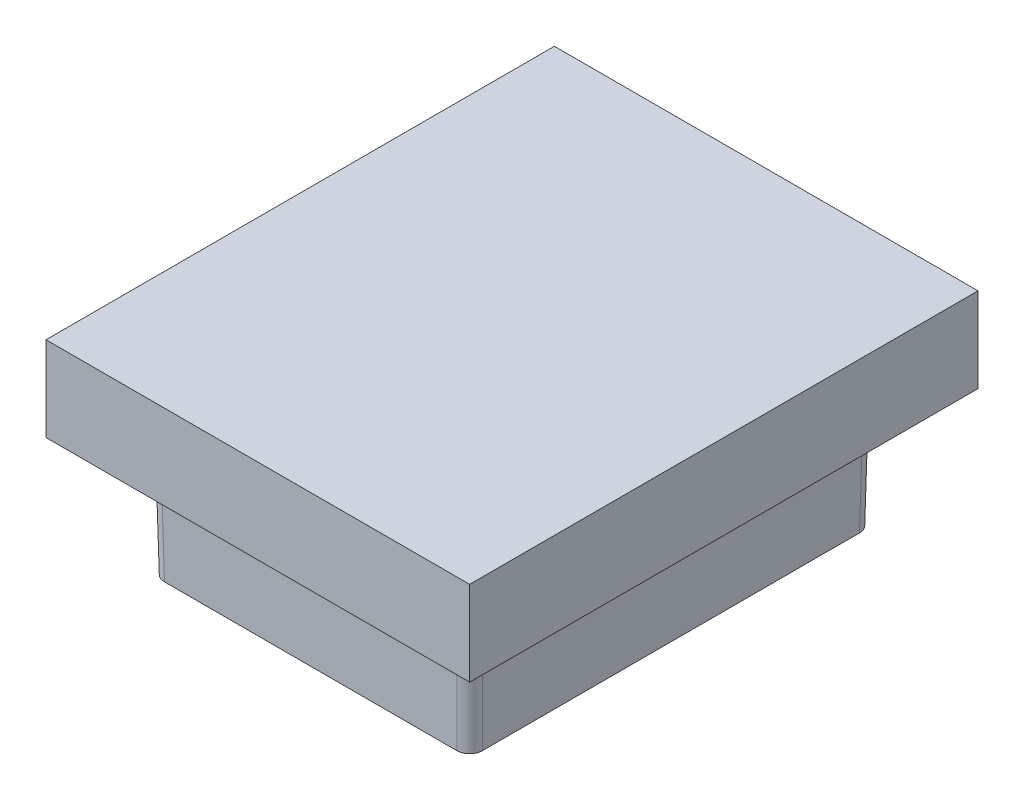
ISO-10303-21;
HEADER;
FILE_DESCRIPTION(('STEP AP214'),'2;1');
FILE_NAME('part.step','',(''),(''),'','','');
FILE_SCHEMA(('AUTOMOTIVE_DESIGN { 1 0 10303 214 1 1 1 1 }'));
ENDSEC;
DATA;
#1=APPLICATION_CONTEXT('core data for automotive mechanical design processes');
#2=APPLICATION_PROTOCOL_DEFINITION('international standard','automotive_design',2000,#1);
#3=PRODUCT_CONTEXT('',#1,'mechanical');
#4=PRODUCT('Part','Part','',(#3));
#5=PRODUCT_RELATED_PRODUCT_CATEGORY('part','',(#4));
#6=PRODUCT_DEFINITION_FORMATION('','',#4);
#7=PRODUCT_DEFINITION_CONTEXT('part definition',#1,'design');
#8=PRODUCT_DEFINITION('design','',#6,#7);
#9=PRODUCT_DEFINITION_SHAPE('','',#8);
#10=(LENGTH_UNIT() NAMED_UNIT(*) SI_UNIT(.MILLI.,.METRE.));
#11=(NAMED_UNIT(*) PLANE_ANGLE_UNIT() SI_UNIT($,.RADIAN.));
#12=(NAMED_UNIT(*) SI_UNIT($,.STERADIAN.) SOLID_ANGLE_UNIT());
#13=UNCERTAINTY_MEASURE_WITH_UNIT(LENGTH_MEASURE(1.E-05),#10,'distance_accuracy_value','');
#14=(GEOMETRIC_REPRESENTATION_CONTEXT(3) GLOBAL_UNCERTAINTY_ASSIGNED_CONTEXT((#13)) GLOBAL_UNIT_ASSIGNED_CONTEXT((#10,
#11,#12)) REPRESENTATION_CONTEXT('',''));
#15=CARTESIAN_POINT('',(0.,0.,0.));
#16=DIRECTION('',(0.,0.,1.));
#17=DIRECTION('',(1.,0.,0.));
#18=AXIS2_PLACEMENT_3D('',#15,#16,#17);
#19=CARTESIAN_POINT('',(0.,70.,0.));
#20=DIRECTION('',(0.,-1.,0.));
#21=DIRECTION('',(0.,0.,-1.));
#22=AXIS2_PLACEMENT_3D('',#19,#20,#21);
#23=PLANE('',#22);
#24=DIRECTION('',(0.,0.,-1.));
#25=VECTOR('',#24,1.);
#26=CARTESIAN_POINT('',(-50.,70.,60.));
#27=LINE('',#26,#25);
#28=CARTESIAN_POINT('',(-50.,70.,60.));
#29=VERTEX_POINT('',#28);
#30=CARTESIAN_POINT('',(-50.,70.,-60.));
#31=VERTEX_POINT('',#30);
#32=EDGE_CURVE('E145',#29,#31,#27,.T.);
#33=ORIENTED_EDGE('',*,*,#32,.F.);
#34=DIRECTION('',(-1.,0.,0.));
#35=VECTOR('',#34,1.);
#36=CARTESIAN_POINT('',(-50.,70.,60.));
#37=LINE('',#36,#35);
#38=CARTESIAN_POINT('',(50.,70.,60.));
#39=VERTEX_POINT('',#38);
#40=EDGE_CURVE('E140',#39,#29,#37,.T.);
#41=ORIENTED_EDGE('',*,*,#40,.F.);
#42=DIRECTION('',(0.,0.,1.));
#43=VECTOR('',#42,1.);
#44=CARTESIAN_POINT('',(50.,70.,60.));
#45=LINE('',#44,#43);
#46=CARTESIAN_POINT('',(50.,70.,-60.));
#47=VERTEX_POINT('',#46);
#48=EDGE_CURVE('E148',#47,#39,#45,.T.);
#49=ORIENTED_EDGE('',*,*,#48,.F.);
#50=DIRECTION('',(1.,0.,0.));
#51=VECTOR('',#50,1.);
#52=CARTESIAN_POINT('',(-50.,70.,-60.));
#53=LINE('',#52,#51);
#54=EDGE_CURVE('E135',#31,#47,#53,.T.);
#55=ORIENTED_EDGE('',*,*,#54,.F.);
#56=EDGE_LOOP('',(#33,#41,#49,#55));
#57=FACE_BOUND('',#56,.T.);
#58=ADVANCED_FACE('F35',(#57),#23,.F.);
#59=CARTESIAN_POINT('',(-50.,70.,-60.));
#60=DIRECTION('',(0.,0.,-1.));
#61=DIRECTION('',(-1.,0.,0.));
#62=AXIS2_PLACEMENT_3D('',#59,#60,#61);
#63=PLANE('',#62);
#64=DIRECTION('',(0.,-1.,0.));
#65=VECTOR('',#64,1.);
#66=CARTESIAN_POINT('',(50.,70.,-60.));
#67=LINE('',#66,#65);
#68=CARTESIAN_POINT('',(50.,50.,-60.));
#69=VERTEX_POINT('',#68);
#70=EDGE_CURVE('E139',#47,#69,#67,.T.);
#71=ORIENTED_EDGE('',*,*,#70,.T.);
#72=DIRECTION('',(-1.,0.,0.));
#73=VECTOR('',#72,1.);
#74=CARTESIAN_POINT('',(-50.,50.,-60.));
#75=LINE('',#74,#73);
#76=CARTESIAN_POINT('',(-50.,50.,-60.));
#77=VERTEX_POINT('',#76);
#78=EDGE_CURVE('E39',#69,#77,#75,.T.);
#79=ORIENTED_EDGE('',*,*,#78,.T.);
#80=DIRECTION('',(0.,-1.,0.));
#81=VECTOR('',#80,1.);
#82=CARTESIAN_POINT('',(-50.,70.,-60.));
#83=LINE('',#82,#81);
#84=EDGE_CURVE('E131',#31,#77,#83,.T.);
#85=ORIENTED_EDGE('',*,*,#84,.F.);
#86=ORIENTED_EDGE('',*,*,#54,.T.);
#87=EDGE_LOOP('',(#71,#79,#85,#86));
#88=FACE_BOUND('',#87,.T.);
#89=ADVANCED_FACE('F134',(#88),#63,.T.);
#90=CARTESIAN_POINT('',(50.,70.,60.));
#91=DIRECTION('',(1.,0.,0.));
#92=DIRECTION('',(0.,0.,-1.));
#93=AXIS2_PLACEMENT_3D('',#90,#91,#92);
#94=PLANE('',#93);
#95=DIRECTION('',(0.,-1.,0.));
#96=VECTOR('',#95,1.);
#97=CARTESIAN_POINT('',(50.,70.,60.));
#98=LINE('',#97,#96);
#99=CARTESIAN_POINT('',(50.,50.,60.));
#100=VERTEX_POINT('',#99);
#101=EDGE_CURVE('E160',#39,#100,#98,.T.);
#102=ORIENTED_EDGE('',*,*,#101,.T.);
#103=DIRECTION('',(0.,0.,-1.));
#104=VECTOR('',#103,1.);
#105=CARTESIAN_POINT('',(50.,50.,60.));
#106=LINE('',#105,#104);
#107=EDGE_CURVE('E166',#100,#69,#106,.T.);
#108=ORIENTED_EDGE('',*,*,#107,.T.);
#109=ORIENTED_EDGE('',*,*,#70,.F.);
#110=ORIENTED_EDGE('',*,*,#48,.T.);
#111=EDGE_LOOP('',(#102,#108,#109,#110));
#112=FACE_BOUND('',#111,.T.);
#113=ADVANCED_FACE('F165',(#112),#94,.T.);
#114=CARTESIAN_POINT('',(-50.,70.,60.));
#115=DIRECTION('',(0.,0.,1.));
#116=DIRECTION('',(1.,0.,0.));
#117=AXIS2_PLACEMENT_3D('',#114,#115,#116);
#118=PLANE('',#117);
#119=DIRECTION('',(0.,-1.,0.));
#120=VECTOR('',#119,1.);
#121=CARTESIAN_POINT('',(-50.,70.,60.));
#122=LINE('',#121,#120);
#123=CARTESIAN_POINT('',(-50.,50.,60.));
#124=VERTEX_POINT('',#123);
#125=EDGE_CURVE('E151',#29,#124,#122,.T.);
#126=ORIENTED_EDGE('',*,*,#125,.T.);
#127=DIRECTION('',(1.,0.,0.));
#128=VECTOR('',#127,1.);
#129=CARTESIAN_POINT('',(-50.,50.,60.));
#130=LINE('',#129,#128);
#131=EDGE_CURVE('E170',#124,#100,#130,.T.);
#132=ORIENTED_EDGE('',*,*,#131,.T.);
#133=ORIENTED_EDGE('',*,*,#101,.F.);
#134=ORIENTED_EDGE('',*,*,#40,.T.);
#135=EDGE_LOOP('',(#126,#132,#133,#134));
#136=FACE_BOUND('',#135,.T.);
#137=ADVANCED_FACE('F320',(#136),#118,.T.);
#138=CARTESIAN_POINT('',(-50.,70.,60.));
#139=DIRECTION('',(-1.,0.,0.));
#140=DIRECTION('',(0.,0.,1.));
#141=AXIS2_PLACEMENT_3D('',#138,#139,#140);
#142=PLANE('',#141);
#143=ORIENTED_EDGE('',*,*,#84,.T.);
#144=DIRECTION('',(0.,0.,1.));
#145=VECTOR('',#144,1.);
#146=CARTESIAN_POINT('',(-50.,50.,60.));
#147=LINE('',#146,#145);
#148=EDGE_CURVE('E154',#77,#124,#147,.T.);
#149=ORIENTED_EDGE('',*,*,#148,.T.);
#150=ORIENTED_EDGE('',*,*,#125,.F.);
#151=ORIENTED_EDGE('',*,*,#32,.T.);
#152=EDGE_LOOP('',(#143,#149,#150,#151));
#153=FACE_BOUND('',#152,.T.);
#154=ADVANCED_FACE('F37',(#153),#142,.T.);
#155=CARTESIAN_POINT('',(35.0022837610675,50.1744709228868,-45.0022837610676));
#156=DIRECTION('',(0.0174497491606827,0.999695459881887,-0.0174497491606827));
#157=DIRECTION('',(0.,0.0174524064372835,0.999847695156391));
#158=AXIS2_PLACEMENT_3D('',#155,#156,#157);
#159=CYLINDRICAL_SURFACE('',#158,3.);
#160=CARTESIAN_POINT('',(34.5104965417903,22.,-44.5104965417904));
#161=DIRECTION('',(0.,-1.,0.));
#162=DIRECTION('',(0.707106781186547,0.,-0.707106781186548));
#163=AXIS2_PLACEMENT_3D('',#160,#161,#162);
#164=ELLIPSE('',#163,3.00091389867315,3.);
#165=CARTESIAN_POINT('',(34.5114104404529,22.,-47.5109535259221));
#166=VERTEX_POINT('',#165);
#167=CARTESIAN_POINT('',(37.5109535259221,22.,-44.5114104404529));
#168=VERTEX_POINT('',#167);
#169=EDGE_CURVE('E169',#166,#168,#164,.T.);
#170=ORIENTED_EDGE('',*,*,#169,.F.);
#171=DIRECTION('',(0.0174497491606827,0.999695459881887,-0.0174497491606827));
#172=VECTOR('',#171,1.);
#173=CARTESIAN_POINT('',(35.0022837610675,50.1221137035749,-48.0018268465367));
#174=LINE('',#173,#172);
#175=CARTESIAN_POINT('',(35.000152258443,50.,-47.9996953439122));
#176=VERTEX_POINT('',#175);
#177=EDGE_CURVE('E192',#176,#166,#174,.F.);
#178=ORIENTED_EDGE('',*,*,#177,.F.);
#179=CARTESIAN_POINT('',(34.9992383597804,50.,-44.9992383597805));
#180=DIRECTION('',(0.,-1.,0.));
#181=DIRECTION('',(0.707106781186547,0.,-0.707106781186548));
#182=AXIS2_PLACEMENT_3D('',#179,#180,#181);
#183=ELLIPSE('',#182,3.00091389867315,3.);
#184=CARTESIAN_POINT('',(37.9996953439122,50.,-45.000152258443));
#185=VERTEX_POINT('',#184);
#186=EDGE_CURVE('E195',#185,#176,#183,.F.);
#187=ORIENTED_EDGE('',*,*,#186,.F.);
#188=DIRECTION('',(0.0174497491606827,0.999695459881887,-0.0174497491606827));
#189=VECTOR('',#188,1.);
#190=CARTESIAN_POINT('',(38.0018268465367,50.1221137035749,-45.0022837610676));
#191=LINE('',#190,#189);
#192=EDGE_CURVE('E173',#168,#185,#191,.T.);
#193=ORIENTED_EDGE('',*,*,#192,.F.);
#194=EDGE_LOOP('',(#170,#178,#187,#193));
#195=FACE_BOUND('',#194,.T.);
#196=ADVANCED_FACE('F287',(#195),#159,.T.);
#197=CARTESIAN_POINT('',(35.0022837610675,50.1744709228868,45.0022837610675));
#198=DIRECTION('',(0.0174497491606827,0.999695459881887,0.0174497491606827));
#199=DIRECTION('',(-0.999847695156391,0.0174524064372836,0.));
#200=AXIS2_PLACEMENT_3D('',#197,#198,#199);
#201=CYLINDRICAL_SURFACE('',#200,3.);
#202=CARTESIAN_POINT('',(34.5104965417904,22.,44.5104965417904));
#203=DIRECTION('',(0.,-1.,0.));
#204=DIRECTION('',(0.707106781186548,0.,0.707106781186547));
#205=AXIS2_PLACEMENT_3D('',#202,#203,#204);
#206=ELLIPSE('',#205,3.00091389867315,3.);
#207=CARTESIAN_POINT('',(37.5109535259221,22.,44.5114104404529));
#208=VERTEX_POINT('',#207);
#209=CARTESIAN_POINT('',(34.5114104404529,22.,47.5109535259221));
#210=VERTEX_POINT('',#209);
#211=EDGE_CURVE('E180',#208,#210,#206,.T.);
#212=ORIENTED_EDGE('',*,*,#211,.F.);
#213=DIRECTION('',(0.0174497491606827,0.999695459881887,0.0174497491606827));
#214=VECTOR('',#213,1.);
#215=CARTESIAN_POINT('',(38.0018268465367,50.1221137035749,45.0022837610675));
#216=LINE('',#215,#214);
#217=CARTESIAN_POINT('',(37.9996953439122,50.,45.000152258443));
#218=VERTEX_POINT('',#217);
#219=EDGE_CURVE('E260',#218,#208,#216,.F.);
#220=ORIENTED_EDGE('',*,*,#219,.F.);
#221=CARTESIAN_POINT('',(34.9992383597804,50.,44.9992383597804));
#222=DIRECTION('',(0.,-1.,0.));
#223=DIRECTION('',(0.707106781186548,0.,0.707106781186547));
#224=AXIS2_PLACEMENT_3D('',#221,#222,#223);
#225=ELLIPSE('',#224,3.00091389867315,3.);
#226=CARTESIAN_POINT('',(35.000152258443,50.,47.9996953439122));
#227=VERTEX_POINT('',#226);
#228=EDGE_CURVE('E179',#227,#218,#225,.F.);
#229=ORIENTED_EDGE('',*,*,#228,.F.);
#230=DIRECTION('',(0.0174497491606827,0.999695459881887,0.0174497491606827));
#231=VECTOR('',#230,1.);
#232=CARTESIAN_POINT('',(35.0022837610675,50.1221137035749,48.0018268465367));
#233=LINE('',#232,#231);
#234=EDGE_CURVE('E176',#210,#227,#233,.T.);
#235=ORIENTED_EDGE('',*,*,#234,.F.);
#236=EDGE_LOOP('',(#212,#220,#229,#235));
#237=FACE_BOUND('',#236,.T.);
#238=ADVANCED_FACE('F281',(#237),#201,.T.);
#239=CARTESIAN_POINT('',(40.,50.0349048128746,48.0003046096872));
#240=DIRECTION('',(0.,-0.0174524064372835,0.999847695156391));
#241=DIRECTION('',(0.,-0.999847695156391,-0.0174524064372835));
#242=AXIS2_PLACEMENT_3D('',#239,#240,#241);
#243=PLANE('',#242);
#244=DIRECTION('',(1.,0.,0.));
#245=VECTOR('',#244,1.);
#246=CARTESIAN_POINT('',(40.,50.,47.9996953439122));
#247=LINE('',#246,#245);
#248=CARTESIAN_POINT('',(-35.000152258443,50.,47.9996953439122));
#249=VERTEX_POINT('',#248);
#250=EDGE_CURVE('E243',#249,#227,#247,.T.);
#251=ORIENTED_EDGE('',*,*,#250,.F.);
#252=DIRECTION('',(-0.0174497491606827,0.999695459881887,0.0174497491606827));
#253=VECTOR('',#252,1.);
#254=CARTESIAN_POINT('',(-34.9718343864905,48.3776702023737,47.9713774719596));
#255=LINE('',#254,#253);
#256=CARTESIAN_POINT('',(-34.5114104404529,22.,47.5109535259221));
#257=VERTEX_POINT('',#256);
#258=EDGE_CURVE('E181',#249,#257,#255,.F.);
#259=ORIENTED_EDGE('',*,*,#258,.T.);
#260=DIRECTION('',(1.,0.,0.));
#261=VECTOR('',#260,1.);
#262=CARTESIAN_POINT('',(40.,22.,47.5109535259221));
#263=LINE('',#262,#261);
#264=EDGE_CURVE('E185',#257,#210,#263,.T.);
#265=ORIENTED_EDGE('',*,*,#264,.T.);
#266=ORIENTED_EDGE('',*,*,#234,.T.);
#267=EDGE_LOOP('',(#251,#259,#265,#266));
#268=FACE_BOUND('',#267,.T.);
#269=ADVANCED_FACE('F302',(#268),#243,.T.);
#270=CARTESIAN_POINT('',(-34.9718343864905,48.4300274216855,44.9718343864904));
#271=DIRECTION('',(-0.0174497491606827,0.999695459881887,0.0174497491606827));
#272=DIRECTION('',(0.,-0.0174524064372835,0.999847695156391));
#273=AXIS2_PLACEMENT_3D('',#270,#271,#272);
#274=CYLINDRICAL_SURFACE('',#273,3.);
#275=CARTESIAN_POINT('',(-34.5104965417904,22.,44.5104965417904));
#276=DIRECTION('',(0.,-1.,0.));
#277=DIRECTION('',(-0.707106781186547,0.,0.707106781186548));
#278=AXIS2_PLACEMENT_3D('',#275,#276,#277);
#279=ELLIPSE('',#278,3.00091389867315,3.);
#280=CARTESIAN_POINT('',(-37.5109535259221,22.,44.5114104404529));
#281=VERTEX_POINT('',#280);
#282=EDGE_CURVE('E184',#257,#281,#279,.T.);
#283=ORIENTED_EDGE('',*,*,#282,.F.);
#284=ORIENTED_EDGE('',*,*,#258,.F.);
#285=CARTESIAN_POINT('',(-34.9992383597805,50.,44.9992383597804));
#286=DIRECTION('',(0.,-1.,0.));
#287=DIRECTION('',(-0.707106781186547,0.,0.707106781186548));
#288=AXIS2_PLACEMENT_3D('',#285,#286,#287);
#289=ELLIPSE('',#288,3.00091389867315,3.);
#290=CARTESIAN_POINT('',(-37.9996953439122,50.,45.000152258443));
#291=VERTEX_POINT('',#290);
#292=EDGE_CURVE('E188',#291,#249,#289,.F.);
#293=ORIENTED_EDGE('',*,*,#292,.F.);
#294=DIRECTION('',(-0.0174497491606827,0.999695459881887,0.0174497491606827));
#295=VECTOR('',#294,1.);
#296=CARTESIAN_POINT('',(-37.9713774719596,48.3776702023737,44.9718343864904));
#297=LINE('',#296,#295);
#298=EDGE_CURVE('E186',#281,#291,#297,.T.);
#299=ORIENTED_EDGE('',*,*,#298,.F.);
#300=EDGE_LOOP('',(#283,#284,#293,#299));
#301=FACE_BOUND('',#300,.T.);
#302=ADVANCED_FACE('F300',(#301),#274,.T.);
#303=CARTESIAN_POINT('',(-38.0003046096872,50.0349048128746,-50.));
#304=DIRECTION('',(-0.999847695156391,-0.0174524064372835,0.));
#305=DIRECTION('',(0.0174524064372835,-0.999847695156391,0.));
#306=AXIS2_PLACEMENT_3D('',#303,#304,#305);
#307=PLANE('',#306);
#308=DIRECTION('',(0.,0.,1.));
#309=VECTOR('',#308,1.);
#310=CARTESIAN_POINT('',(-37.9996953439122,50.,-50.));
#311=LINE('',#310,#309);
#312=CARTESIAN_POINT('',(-37.9996953439122,50.,-45.000152258443));
#313=VERTEX_POINT('',#312);
#314=EDGE_CURVE('E67',#313,#291,#311,.T.);
#315=ORIENTED_EDGE('',*,*,#314,.F.);
#316=DIRECTION('',(-0.0174497491606827,0.999695459881887,-0.0174497491606827));
#317=VECTOR('',#316,1.);
#318=CARTESIAN_POINT('',(-37.9774673468751,48.7265589026139,-44.9779242614059));
#319=LINE('',#318,#317);
#320=CARTESIAN_POINT('',(-37.5109535259221,22.,-44.5114104404529));
#321=VERTEX_POINT('',#320);
#322=EDGE_CURVE('E189',#313,#321,#319,.F.);
#323=ORIENTED_EDGE('',*,*,#322,.T.);
#324=DIRECTION('',(0.,0.,1.));
#325=VECTOR('',#324,1.);
#326=CARTESIAN_POINT('',(-37.5109535259221,22.,-50.));
#327=LINE('',#326,#325);
#328=EDGE_CURVE('E191',#321,#281,#327,.T.);
#329=ORIENTED_EDGE('',*,*,#328,.T.);
#330=ORIENTED_EDGE('',*,*,#298,.T.);
#331=EDGE_LOOP('',(#315,#323,#329,#330));
#332=FACE_BOUND('',#331,.T.);
#333=ADVANCED_FACE('F295',(#332),#307,.T.);
#334=CARTESIAN_POINT('',(-34.9779242614059,48.7789161219258,-44.9779242614059));
#335=DIRECTION('',(-0.0174497491606827,0.999695459881887,-0.0174497491606827));
#336=DIRECTION('',(-0.999847695156391,-0.0174524064372836,0.));
#337=AXIS2_PLACEMENT_3D('',#334,#335,#336);
#338=CYLINDRICAL_SURFACE('',#337,3.);
#339=CARTESIAN_POINT('',(-34.5104965417904,22.,-44.5104965417904));
#340=DIRECTION('',(0.,-1.,0.));
#341=DIRECTION('',(-0.707106781186548,0.,-0.707106781186547));
#342=AXIS2_PLACEMENT_3D('',#339,#340,#341);
#343=ELLIPSE('',#342,3.00091389867315,3.);
#344=CARTESIAN_POINT('',(-34.5114104404529,22.,-47.5109535259221));
#345=VERTEX_POINT('',#344);
#346=EDGE_CURVE('E71',#321,#345,#343,.T.);
#347=ORIENTED_EDGE('',*,*,#346,.F.);
#348=ORIENTED_EDGE('',*,*,#322,.F.);
#349=CARTESIAN_POINT('',(-34.9992383597805,50.,-44.9992383597805));
#350=DIRECTION('',(0.,-1.,0.));
#351=DIRECTION('',(-0.707106781186548,0.,-0.707106781186547));
#352=AXIS2_PLACEMENT_3D('',#349,#350,#351);
#353=ELLIPSE('',#352,3.00091389867315,3.);
#354=CARTESIAN_POINT('',(-35.000152258443,50.,-47.9996953439122));
#355=VERTEX_POINT('',#354);
#356=EDGE_CURVE('E54',#355,#313,#353,.F.);
#357=ORIENTED_EDGE('',*,*,#356,.F.);
#358=DIRECTION('',(-0.0174497491606827,0.999695459881887,-0.0174497491606827));
#359=VECTOR('',#358,1.);
#360=CARTESIAN_POINT('',(-34.9779242614059,48.7265589026139,-47.9774673468751));
#361=LINE('',#360,#359);
#362=EDGE_CURVE('E196',#345,#355,#361,.T.);
#363=ORIENTED_EDGE('',*,*,#362,.F.);
#364=EDGE_LOOP('',(#347,#348,#357,#363));
#365=FACE_BOUND('',#364,.T.);
#366=ADVANCED_FACE('F294',(#365),#338,.T.);
#367=CARTESIAN_POINT('',(40.,50.0349048128746,-48.0003046096872));
#368=DIRECTION('',(0.,-0.0174524064372835,-0.999847695156391));
#369=DIRECTION('',(0.,0.999847695156391,-0.0174524064372835));
#370=AXIS2_PLACEMENT_3D('',#367,#368,#369);
#371=PLANE('',#370);
#372=DIRECTION('',(-1.,0.,0.));
#373=VECTOR('',#372,1.);
#374=CARTESIAN_POINT('',(40.,50.,-47.9996953439122));
#375=LINE('',#374,#373);
#376=EDGE_CURVE('E249',#176,#355,#375,.T.);
#377=ORIENTED_EDGE('',*,*,#376,.F.);
#378=ORIENTED_EDGE('',*,*,#177,.T.);
#379=DIRECTION('',(-1.,0.,0.));
#380=VECTOR('',#379,1.);
#381=CARTESIAN_POINT('',(40.,22.,-47.5109535259221));
#382=LINE('',#381,#380);
#383=EDGE_CURVE('E203',#166,#345,#382,.T.);
#384=ORIENTED_EDGE('',*,*,#383,.T.);
#385=ORIENTED_EDGE('',*,*,#362,.T.);
#386=EDGE_LOOP('',(#377,#378,#384,#385));
#387=FACE_BOUND('',#386,.T.);
#388=ADVANCED_FACE('F293',(#387),#371,.T.);
#389=CARTESIAN_POINT('',(-30.,30.,40.));
#390=DIRECTION('',(0.,1.,0.));
#391=DIRECTION('',(0.,0.,1.));
#392=AXIS2_PLACEMENT_3D('',#389,#390,#391);
#393=PLANE('',#392);
#394=CARTESIAN_POINT('',(-30.,30.,40.));
#395=DIRECTION('',(0.,1.,0.));
#396=DIRECTION('',(0.,0.,1.));
#397=AXIS2_PLACEMENT_3D('',#394,#395,#396);
#398=CIRCLE('',#397,1.32546264418483);
#399=CARTESIAN_POINT('',(-30.,30.,41.3254626441848));
#400=VERTEX_POINT('',#399);
#401=EDGE_CURVE('E199',#400,#400,#398,.T.);
#402=ORIENTED_EDGE('',*,*,#401,.F.);
#403=EDGE_LOOP('',(#402));
#404=FACE_BOUND('',#403,.T.);
#405=ADVANCED_FACE('F547',(#404),#393,.F.);
#406=CARTESIAN_POINT('',(-30.,50.,40.));
#407=DIRECTION('',(0.,1.,0.));
#408=DIRECTION('',(0.,0.,1.));
#409=AXIS2_PLACEMENT_3D('',#406,#407,#408);
#410=CONICAL_SURFACE('',#409,1.5,0.00872664625997167);
#411=ORIENTED_EDGE('',*,*,#401,.T.);
#412=EDGE_LOOP('',(#411));
#413=FACE_BOUND('',#412,.T.);
#414=CARTESIAN_POINT('',(-30.,50.,40.));
#415=DIRECTION('',(0.,1.,0.));
#416=DIRECTION('',(0.,0.,1.));
#417=AXIS2_PLACEMENT_3D('',#414,#415,#416);
#418=CIRCLE('',#417,1.5);
#419=CARTESIAN_POINT('',(-30.,50.,41.5));
#420=VERTEX_POINT('',#419);
#421=EDGE_CURVE('E202',#420,#420,#418,.T.);
#422=ORIENTED_EDGE('',*,*,#421,.F.);
#423=EDGE_LOOP('',(#422));
#424=FACE_BOUND('',#423,.T.);
#425=ADVANCED_FACE('F536',(#413,#424),#410,.T.);
#426=CARTESIAN_POINT('',(-30.,50.,40.));
#427=DIRECTION('',(0.,1.,0.));
#428=DIRECTION('',(0.,0.,1.));
#429=AXIS2_PLACEMENT_3D('',#426,#427,#428);
#430=PLANE('',#429);
#431=ORIENTED_EDGE('',*,*,#421,.T.);
#432=EDGE_LOOP('',(#431));
#433=FACE_BOUND('',#432,.T.);
#434=CARTESIAN_POINT('',(-30.,50.,40.));
#435=DIRECTION('',(0.,1.,0.));
#436=DIRECTION('',(0.,0.,1.));
#437=AXIS2_PLACEMENT_3D('',#434,#435,#436);
#438=CIRCLE('',#437,3.5);
#439=CARTESIAN_POINT('',(-30.,50.,43.5));
#440=VERTEX_POINT('',#439);
#441=EDGE_CURVE('E206',#440,#440,#438,.T.);
#442=ORIENTED_EDGE('',*,*,#441,.F.);
#443=EDGE_LOOP('',(#442));
#444=FACE_BOUND('',#443,.T.);
#445=ADVANCED_FACE('F525',(#433,#444),#430,.F.);
#446=CARTESIAN_POINT('',(-30.,50.,40.));
#447=DIRECTION('',(0.,-1.,0.));
#448=DIRECTION('',(0.,0.,1.));
#449=AXIS2_PLACEMENT_3D('',#446,#447,#448);
#450=CONICAL_SURFACE('',#449,3.5,0.0174532925199433);
#451=ORIENTED_EDGE('',*,*,#441,.T.);
#452=EDGE_LOOP('',(#451));
#453=FACE_BOUND('',#452,.T.);
#454=CARTESIAN_POINT('',(-30.,22.,40.));
#455=DIRECTION('',(0.,-1.,0.));
#456=DIRECTION('',(0.,0.,-1.));
#457=AXIS2_PLACEMENT_3D('',#454,#455,#456);
#458=CIRCLE('',#457,3.98874181799009);
#459=CARTESIAN_POINT('',(-30.,22.,36.0112581820099));
#460=VERTEX_POINT('',#459);
#461=EDGE_CURVE('E209',#460,#460,#458,.T.);
#462=ORIENTED_EDGE('',*,*,#461,.T.);
#463=EDGE_LOOP('',(#462));
#464=FACE_BOUND('',#463,.T.);
#465=ADVANCED_FACE('F514',(#453,#464),#450,.F.);
#466=CARTESIAN_POINT('',(-30.,30.,-40.));
#467=DIRECTION('',(0.,-1.,0.));
#468=DIRECTION('',(0.,0.,-1.));
#469=AXIS2_PLACEMENT_3D('',#466,#467,#468);
#470=PLANE('',#469);
#471=CARTESIAN_POINT('',(-30.,30.,-40.));
#472=DIRECTION('',(0.,-1.,0.));
#473=DIRECTION('',(0.,0.,-1.));
#474=AXIS2_PLACEMENT_3D('',#471,#472,#473);
#475=CIRCLE('',#474,1.32546264418483);
#476=CARTESIAN_POINT('',(-30.,30.,-41.3254626441848));
#477=VERTEX_POINT('',#476);
#478=EDGE_CURVE('E210',#477,#477,#475,.F.);
#479=ORIENTED_EDGE('',*,*,#478,.F.);
#480=EDGE_LOOP('',(#479));
#481=FACE_BOUND('',#480,.T.);
#482=ADVANCED_FACE('F503',(#481),#470,.T.);
#483=CARTESIAN_POINT('',(-30.,50.,-40.));
#484=DIRECTION('',(0.,1.,0.));
#485=DIRECTION('',(0.,0.,-1.));
#486=AXIS2_PLACEMENT_3D('',#483,#484,#485);
#487=CONICAL_SURFACE('',#486,1.5,0.00872664625997167);
#488=ORIENTED_EDGE('',*,*,#478,.T.);
#489=EDGE_LOOP('',(#488));
#490=FACE_BOUND('',#489,.T.);
#491=CARTESIAN_POINT('',(-30.,50.,-40.));
#492=DIRECTION('',(0.,1.,0.));
#493=DIRECTION('',(0.,0.,-1.));
#494=AXIS2_PLACEMENT_3D('',#491,#492,#493);
#495=CIRCLE('',#494,1.5);
#496=CARTESIAN_POINT('',(-30.,50.,-41.5));
#497=VERTEX_POINT('',#496);
#498=EDGE_CURVE('E213',#497,#497,#495,.T.);
#499=ORIENTED_EDGE('',*,*,#498,.F.);
#500=EDGE_LOOP('',(#499));
#501=FACE_BOUND('',#500,.T.);
#502=ADVANCED_FACE('F492',(#490,#501),#487,.T.);
#503=CARTESIAN_POINT('',(-30.,50.,-40.));
#504=DIRECTION('',(0.,-1.,0.));
#505=DIRECTION('',(0.,0.,-1.));
#506=AXIS2_PLACEMENT_3D('',#503,#504,#505);
#507=PLANE('',#506);
#508=ORIENTED_EDGE('',*,*,#498,.T.);
#509=EDGE_LOOP('',(#508));
#510=FACE_BOUND('',#509,.T.);
#511=CARTESIAN_POINT('',(-30.,50.,-40.));
#512=DIRECTION('',(0.,1.,0.));
#513=DIRECTION('',(0.,0.,-1.));
#514=AXIS2_PLACEMENT_3D('',#511,#512,#513);
#515=CIRCLE('',#514,3.5);
#516=CARTESIAN_POINT('',(-30.,50.,-43.5));
#517=VERTEX_POINT('',#516);
#518=EDGE_CURVE('E216',#517,#517,#515,.T.);
#519=ORIENTED_EDGE('',*,*,#518,.F.);
#520=EDGE_LOOP('',(#519));
#521=FACE_BOUND('',#520,.T.);
#522=ADVANCED_FACE('F481',(#510,#521),#507,.T.);
#523=CARTESIAN_POINT('',(-30.,50.,-40.));
#524=DIRECTION('',(0.,-1.,0.));
#525=DIRECTION('',(0.,0.,-1.));
#526=AXIS2_PLACEMENT_3D('',#523,#524,#525);
#527=CONICAL_SURFACE('',#526,3.5,0.0174532925199433);
#528=ORIENTED_EDGE('',*,*,#518,.T.);
#529=EDGE_LOOP('',(#528));
#530=FACE_BOUND('',#529,.T.);
#531=CARTESIAN_POINT('',(-30.,22.,-40.));
#532=DIRECTION('',(0.,-1.,0.));
#533=DIRECTION('',(0.,0.,-1.));
#534=AXIS2_PLACEMENT_3D('',#531,#532,#533);
#535=CIRCLE('',#534,3.98874181799009);
#536=CARTESIAN_POINT('',(-30.,22.,-43.9887418179901));
#537=VERTEX_POINT('',#536);
#538=EDGE_CURVE('E219',#537,#537,#535,.T.);
#539=ORIENTED_EDGE('',*,*,#538,.T.);
#540=EDGE_LOOP('',(#539));
#541=FACE_BOUND('',#540,.T.);
#542=ADVANCED_FACE('F470',(#530,#541),#527,.F.);
#543=CARTESIAN_POINT('',(30.,30.,-40.));
#544=DIRECTION('',(0.,1.,0.));
#545=DIRECTION('',(0.,0.,1.));
#546=AXIS2_PLACEMENT_3D('',#543,#544,#545);
#547=PLANE('',#546);
#548=CARTESIAN_POINT('',(30.,30.,-40.));
#549=DIRECTION('',(0.,1.,0.));
#550=DIRECTION('',(0.,0.,1.));
#551=AXIS2_PLACEMENT_3D('',#548,#549,#550);
#552=CIRCLE('',#551,1.32546264418483);
#553=CARTESIAN_POINT('',(30.,30.,-38.6745373558152));
#554=VERTEX_POINT('',#553);
#555=EDGE_CURVE('E220',#554,#554,#552,.T.);
#556=ORIENTED_EDGE('',*,*,#555,.F.);
#557=EDGE_LOOP('',(#556));
#558=FACE_BOUND('',#557,.T.);
#559=ADVANCED_FACE('F459',(#558),#547,.F.);
#560=CARTESIAN_POINT('',(30.,50.,-40.));
#561=DIRECTION('',(0.,1.,0.));
#562=DIRECTION('',(0.,0.,1.));
#563=AXIS2_PLACEMENT_3D('',#560,#561,#562);
#564=CONICAL_SURFACE('',#563,1.50000000000001,0.00872664625997167);
#565=ORIENTED_EDGE('',*,*,#555,.T.);
#566=EDGE_LOOP('',(#565));
#567=FACE_BOUND('',#566,.T.);
#568=CARTESIAN_POINT('',(30.,50.,-40.));
#569=DIRECTION('',(0.,1.,0.));
#570=DIRECTION('',(0.,0.,1.));
#571=AXIS2_PLACEMENT_3D('',#568,#569,#570);
#572=CIRCLE('',#571,1.50000000000001);
#573=CARTESIAN_POINT('',(30.,50.,-38.5));
#574=VERTEX_POINT('',#573);
#575=EDGE_CURVE('E223',#574,#574,#572,.T.);
#576=ORIENTED_EDGE('',*,*,#575,.F.);
#577=EDGE_LOOP('',(#576));
#578=FACE_BOUND('',#577,.T.);
#579=ADVANCED_FACE('F448',(#567,#578),#564,.T.);
#580=CARTESIAN_POINT('',(30.,50.,-40.));
#581=DIRECTION('',(0.,1.,0.));
#582=DIRECTION('',(0.,0.,1.));
#583=AXIS2_PLACEMENT_3D('',#580,#581,#582);
#584=PLANE('',#583);
#585=ORIENTED_EDGE('',*,*,#575,.T.);
#586=EDGE_LOOP('',(#585));
#587=FACE_BOUND('',#586,.T.);
#588=CARTESIAN_POINT('',(30.,50.,-40.));
#589=DIRECTION('',(0.,1.,0.));
#590=DIRECTION('',(0.,0.,1.));
#591=AXIS2_PLACEMENT_3D('',#588,#589,#590);
#592=CIRCLE('',#591,3.5);
#593=CARTESIAN_POINT('',(30.,50.,-36.5));
#594=VERTEX_POINT('',#593);
#595=EDGE_CURVE('E226',#594,#594,#592,.T.);
#596=ORIENTED_EDGE('',*,*,#595,.F.);
#597=EDGE_LOOP('',(#596));
#598=FACE_BOUND('',#597,.T.);
#599=ADVANCED_FACE('F437',(#587,#598),#584,.F.);
#600=CARTESIAN_POINT('',(30.,50.,-40.));
#601=DIRECTION('',(0.,-1.,0.));
#602=DIRECTION('',(0.,0.,1.));
#603=AXIS2_PLACEMENT_3D('',#600,#601,#602);
#604=CONICAL_SURFACE('',#603,3.5,0.0174532925199433);
#605=ORIENTED_EDGE('',*,*,#595,.T.);
#606=EDGE_LOOP('',(#605));
#607=FACE_BOUND('',#606,.T.);
#608=CARTESIAN_POINT('',(30.,22.,-40.));
#609=DIRECTION('',(0.,-1.,0.));
#610=DIRECTION('',(0.,0.,-1.));
#611=AXIS2_PLACEMENT_3D('',#608,#609,#610);
#612=CIRCLE('',#611,3.98874181799009);
#613=CARTESIAN_POINT('',(30.,22.,-43.9887418179901));
#614=VERTEX_POINT('',#613);
#615=EDGE_CURVE('E229',#614,#614,#612,.T.);
#616=ORIENTED_EDGE('',*,*,#615,.T.);
#617=EDGE_LOOP('',(#616));
#618=FACE_BOUND('',#617,.T.);
#619=ADVANCED_FACE('F426',(#607,#618),#604,.F.);
#620=CARTESIAN_POINT('',(30.,30.,40.));
#621=DIRECTION('',(0.,-1.,0.));
#622=DIRECTION('',(0.,0.,-1.));
#623=AXIS2_PLACEMENT_3D('',#620,#621,#622);
#624=PLANE('',#623);
#625=CARTESIAN_POINT('',(30.,30.,40.));
#626=DIRECTION('',(0.,-1.,0.));
#627=DIRECTION('',(0.,0.,-1.));
#628=AXIS2_PLACEMENT_3D('',#625,#626,#627);
#629=CIRCLE('',#628,1.32546264418483);
#630=CARTESIAN_POINT('',(30.,30.,38.6745373558152));
#631=VERTEX_POINT('',#630);
#632=EDGE_CURVE('E230',#631,#631,#629,.F.);
#633=ORIENTED_EDGE('',*,*,#632,.F.);
#634=EDGE_LOOP('',(#633));
#635=FACE_BOUND('',#634,.T.);
#636=ADVANCED_FACE('F415',(#635),#624,.T.);
#637=CARTESIAN_POINT('',(30.,50.,40.));
#638=DIRECTION('',(0.,1.,0.));
#639=DIRECTION('',(0.,0.,-1.));
#640=AXIS2_PLACEMENT_3D('',#637,#638,#639);
#641=CONICAL_SURFACE('',#640,1.50000000000001,0.00872664625997167);
#642=ORIENTED_EDGE('',*,*,#632,.T.);
#643=EDGE_LOOP('',(#642));
#644=FACE_BOUND('',#643,.T.);
#645=CARTESIAN_POINT('',(30.,50.,40.));
#646=DIRECTION('',(0.,1.,0.));
#647=DIRECTION('',(0.,0.,-1.));
#648=AXIS2_PLACEMENT_3D('',#645,#646,#647);
#649=CIRCLE('',#648,1.50000000000001);
#650=CARTESIAN_POINT('',(30.,50.,38.5));
#651=VERTEX_POINT('',#650);
#652=EDGE_CURVE('E233',#651,#651,#649,.T.);
#653=ORIENTED_EDGE('',*,*,#652,.F.);
#654=EDGE_LOOP('',(#653));
#655=FACE_BOUND('',#654,.T.);
#656=ADVANCED_FACE('F404',(#644,#655),#641,.T.);
#657=CARTESIAN_POINT('',(30.,50.,40.));
#658=DIRECTION('',(0.,-1.,0.));
#659=DIRECTION('',(0.,0.,-1.));
#660=AXIS2_PLACEMENT_3D('',#657,#658,#659);
#661=PLANE('',#660);
#662=ORIENTED_EDGE('',*,*,#652,.T.);
#663=EDGE_LOOP('',(#662));
#664=FACE_BOUND('',#663,.T.);
#665=CARTESIAN_POINT('',(30.,50.,40.));
#666=DIRECTION('',(0.,1.,0.));
#667=DIRECTION('',(0.,0.,-1.));
#668=AXIS2_PLACEMENT_3D('',#665,#666,#667);
#669=CIRCLE('',#668,3.5);
#670=CARTESIAN_POINT('',(30.,50.,36.5));
#671=VERTEX_POINT('',#670);
#672=EDGE_CURVE('E236',#671,#671,#669,.T.);
#673=ORIENTED_EDGE('',*,*,#672,.F.);
#674=EDGE_LOOP('',(#673));
#675=FACE_BOUND('',#674,.T.);
#676=ADVANCED_FACE('F393',(#664,#675),#661,.T.);
#677=CARTESIAN_POINT('',(30.,50.,40.));
#678=DIRECTION('',(0.,-1.,0.));
#679=DIRECTION('',(0.,0.,-1.));
#680=AXIS2_PLACEMENT_3D('',#677,#678,#679);
#681=CONICAL_SURFACE('',#680,3.5,0.0174532925199433);
#682=ORIENTED_EDGE('',*,*,#672,.T.);
#683=EDGE_LOOP('',(#682));
#684=FACE_BOUND('',#683,.T.);
#685=CARTESIAN_POINT('',(30.,22.,40.));
#686=DIRECTION('',(0.,-1.,0.));
#687=DIRECTION('',(0.,0.,-1.));
#688=AXIS2_PLACEMENT_3D('',#685,#686,#687);
#689=CIRCLE('',#688,3.98874181799009);
#690=CARTESIAN_POINT('',(30.,22.,36.0112581820099));
#691=VERTEX_POINT('',#690);
#692=EDGE_CURVE('E238',#691,#691,#689,.T.);
#693=ORIENTED_EDGE('',*,*,#692,.T.);
#694=EDGE_LOOP('',(#693));
#695=FACE_BOUND('',#694,.T.);
#696=ADVANCED_FACE('F382',(#684,#695),#681,.F.);
#697=CARTESIAN_POINT('',(0.,22.,0.));
#698=DIRECTION('',(0.,-1.,0.));
#699=DIRECTION('',(0.,0.,-1.));
#700=AXIS2_PLACEMENT_3D('',#697,#698,#699);
#701=PLANE('',#700);
#702=ORIENTED_EDGE('',*,*,#692,.F.);
#703=EDGE_LOOP('',(#702));
#704=FACE_BOUND('',#703,.T.);
#705=ORIENTED_EDGE('',*,*,#615,.F.);
#706=EDGE_LOOP('',(#705));
#707=FACE_BOUND('',#706,.T.);
#708=ORIENTED_EDGE('',*,*,#538,.F.);
#709=EDGE_LOOP('',(#708));
#710=FACE_BOUND('',#709,.T.);
#711=ORIENTED_EDGE('',*,*,#461,.F.);
#712=EDGE_LOOP('',(#711));
#713=FACE_BOUND('',#712,.T.);
#714=ORIENTED_EDGE('',*,*,#383,.F.);
#715=ORIENTED_EDGE('',*,*,#169,.T.);
#716=DIRECTION('',(0.,0.,-1.));
#717=VECTOR('',#716,1.);
#718=CARTESIAN_POINT('',(37.5109535259221,22.,-50.));
#719=LINE('',#718,#717);
#720=EDGE_CURVE('E45',#208,#168,#719,.T.);
#721=ORIENTED_EDGE('',*,*,#720,.F.);
#722=ORIENTED_EDGE('',*,*,#211,.T.);
#723=ORIENTED_EDGE('',*,*,#264,.F.);
#724=ORIENTED_EDGE('',*,*,#282,.T.);
#725=ORIENTED_EDGE('',*,*,#328,.F.);
#726=ORIENTED_EDGE('',*,*,#346,.T.);
#727=EDGE_LOOP('',(#714,#715,#721,#722,#723,#724,#725,#726));
#728=FACE_BOUND('',#727,.T.);
#729=ADVANCED_FACE('F290',(#704,#707,#710,#713,#728),#701,.T.);
#730=CARTESIAN_POINT('',(38.0003046096872,50.0349048128746,-50.));
#731=DIRECTION('',(0.999847695156391,-0.0174524064372835,0.));
#732=DIRECTION('',(0.0174524064372835,0.999847695156391,0.));
#733=AXIS2_PLACEMENT_3D('',#730,#731,#732);
#734=PLANE('',#733);
#735=ORIENTED_EDGE('',*,*,#720,.T.);
#736=ORIENTED_EDGE('',*,*,#192,.T.);
#737=DIRECTION('',(0.,0.,-1.));
#738=VECTOR('',#737,1.);
#739=CARTESIAN_POINT('',(37.9996953439122,50.,-50.));
#740=LINE('',#739,#738);
#741=EDGE_CURVE('E11',#218,#185,#740,.T.);
#742=ORIENTED_EDGE('',*,*,#741,.F.);
#743=ORIENTED_EDGE('',*,*,#219,.T.);
#744=EDGE_LOOP('',(#735,#736,#742,#743));
#745=FACE_BOUND('',#744,.T.);
#746=ADVANCED_FACE('F283',(#745),#734,.T.);
#747=CARTESIAN_POINT('',(0.,50.,0.));
#748=DIRECTION('',(0.,-1.,0.));
#749=DIRECTION('',(0.,0.,-1.));
#750=AXIS2_PLACEMENT_3D('',#747,#748,#749);
#751=PLANE('',#750);
#752=ORIENTED_EDGE('',*,*,#741,.T.);
#753=ORIENTED_EDGE('',*,*,#186,.T.);
#754=ORIENTED_EDGE('',*,*,#376,.T.);
#755=ORIENTED_EDGE('',*,*,#356,.T.);
#756=ORIENTED_EDGE('',*,*,#314,.T.);
#757=ORIENTED_EDGE('',*,*,#292,.T.);
#758=ORIENTED_EDGE('',*,*,#250,.T.);
#759=ORIENTED_EDGE('',*,*,#228,.T.);
#760=EDGE_LOOP('',(#752,#753,#754,#755,#756,#757,#758,#759));
#761=FACE_BOUND('',#760,.T.);
#762=ORIENTED_EDGE('',*,*,#78,.F.);
#763=ORIENTED_EDGE('',*,*,#107,.F.);
#764=ORIENTED_EDGE('',*,*,#131,.F.);
#765=ORIENTED_EDGE('',*,*,#148,.F.);
#766=EDGE_LOOP('',(#762,#763,#764,#765));
#767=FACE_BOUND('',#766,.T.);
#768=ADVANCED_FACE('F276',(#761,#767),#751,.T.);
#769=CLOSED_SHELL('',(#58,#89,#113,#137,#154,#196,#238,#269,#302,#333,#366,#388,#405,#425,#445,
#465,#482,#502,#522,#542,#559,#579,#599,#619,#636,#656,#676,#696,#729,#746,#768));
#770=MANIFOLD_SOLID_BREP('B2',#769);
#771=ADVANCED_BREP_SHAPE_REPRESENTATION('',(#18,#770),#14);
#772=SHAPE_DEFINITION_REPRESENTATION(#9,#771);
ENDSEC;
END-ISO-10303-21;
